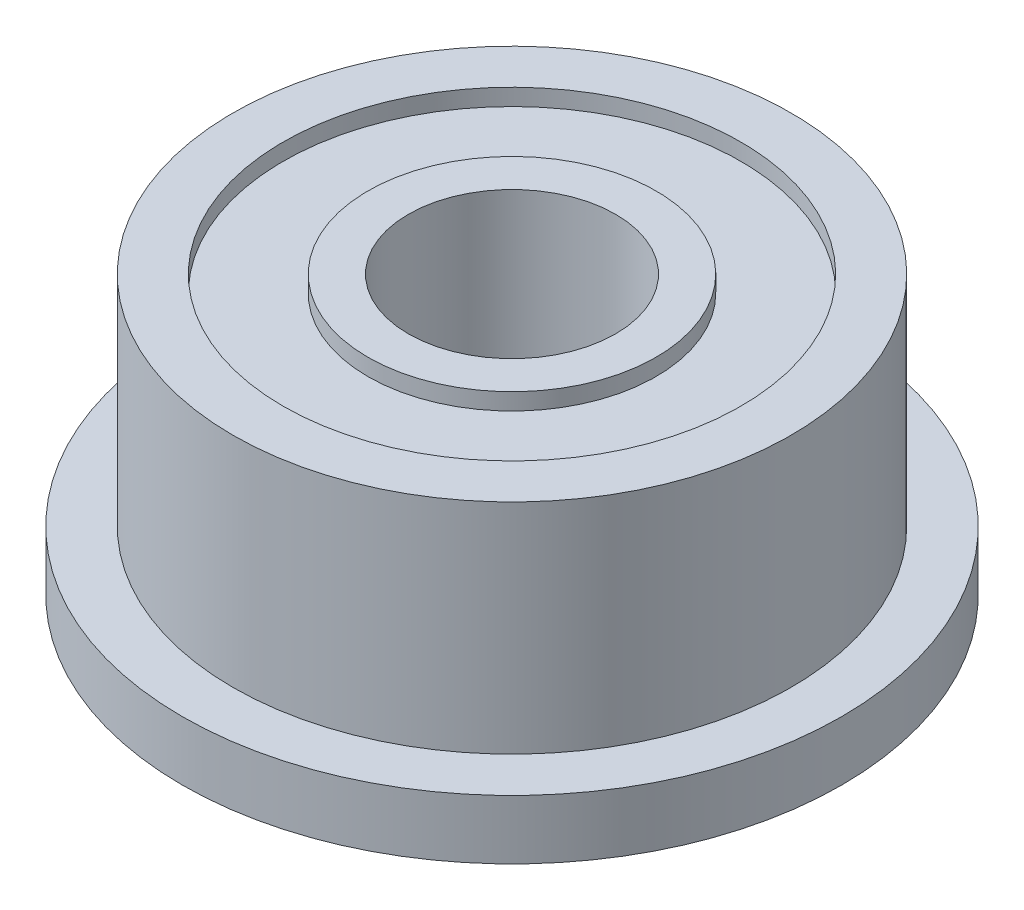
ISO-10303-21;
HEADER;
FILE_DESCRIPTION(('STEP AP214'),'2;1');
FILE_NAME('part.step','',(''),(''),'','','');
FILE_SCHEMA(('AUTOMOTIVE_DESIGN { 1 0 10303 214 1 1 1 1 }'));
ENDSEC;
DATA;
#1=APPLICATION_CONTEXT('core data for automotive mechanical design processes');
#2=APPLICATION_PROTOCOL_DEFINITION('international standard','automotive_design',2000,#1);
#3=PRODUCT_CONTEXT('',#1,'mechanical');
#4=PRODUCT('Part','Part','',(#3));
#5=PRODUCT_RELATED_PRODUCT_CATEGORY('part','',(#4));
#6=PRODUCT_DEFINITION_FORMATION('','',#4);
#7=PRODUCT_DEFINITION_CONTEXT('part definition',#1,'design');
#8=PRODUCT_DEFINITION('design','',#6,#7);
#9=PRODUCT_DEFINITION_SHAPE('','',#8);
#10=(LENGTH_UNIT() NAMED_UNIT(*) SI_UNIT(.MILLI.,.METRE.));
#11=(NAMED_UNIT(*) PLANE_ANGLE_UNIT() SI_UNIT($,.RADIAN.));
#12=(NAMED_UNIT(*) SI_UNIT($,.STERADIAN.) SOLID_ANGLE_UNIT());
#13=UNCERTAINTY_MEASURE_WITH_UNIT(LENGTH_MEASURE(1.E-05),#10,'distance_accuracy_value','');
#14=(GEOMETRIC_REPRESENTATION_CONTEXT(3) GLOBAL_UNCERTAINTY_ASSIGNED_CONTEXT((#13)) GLOBAL_UNIT_ASSIGNED_CONTEXT((#10,
#11,#12)) REPRESENTATION_CONTEXT('',''));
#15=CARTESIAN_POINT('',(0.,0.,0.));
#16=DIRECTION('',(0.,0.,1.));
#17=DIRECTION('',(1.,0.,0.));
#18=AXIS2_PLACEMENT_3D('',#15,#16,#17);
#19=CARTESIAN_POINT('',(3.28,0.24,0.));
#20=DIRECTION('',(0.,-1.,0.));
#21=DIRECTION('',(0.,0.,-1.));
#22=AXIS2_PLACEMENT_3D('',#19,#20,#21);
#23=PLANE('',#22);
#24=CARTESIAN_POINT('',(0.,0.24,0.));
#25=DIRECTION('',(0.,1.,0.));
#26=DIRECTION('',(0.,0.,1.));
#27=AXIS2_PLACEMENT_3D('',#24,#25,#26);
#28=CIRCLE('',#27,2.065);
#29=CARTESIAN_POINT('',(0.,0.24,2.065));
#30=VERTEX_POINT('',#29);
#31=EDGE_CURVE('E77',#30,#30,#28,.T.);
#32=ORIENTED_EDGE('',*,*,#31,.T.);
#33=EDGE_LOOP('',(#32));
#34=FACE_BOUND('',#33,.T.);
#35=CARTESIAN_POINT('',(0.,0.24,0.));
#36=DIRECTION('',(0.,1.,0.));
#37=DIRECTION('',(0.,0.,1.));
#38=AXIS2_PLACEMENT_3D('',#35,#36,#37);
#39=CIRCLE('',#38,3.28);
#40=CARTESIAN_POINT('',(0.,0.24,3.28));
#41=VERTEX_POINT('',#40);
#42=EDGE_CURVE('E10',#41,#41,#39,.T.);
#43=ORIENTED_EDGE('',*,*,#42,.F.);
#44=EDGE_LOOP('',(#43));
#45=FACE_BOUND('',#44,.T.);
#46=ADVANCED_FACE('F31',(#34,#45),#23,.T.);
#47=CARTESIAN_POINT('',(0.,0.,0.));
#48=DIRECTION('',(0.,1.,0.));
#49=DIRECTION('',(0.,0.,1.));
#50=AXIS2_PLACEMENT_3D('',#47,#48,#49);
#51=CYLINDRICAL_SURFACE('',#50,3.28);
#52=ORIENTED_EDGE('',*,*,#42,.T.);
#53=EDGE_LOOP('',(#52));
#54=FACE_BOUND('',#53,.T.);
#55=CARTESIAN_POINT('',(0.,0.,0.));
#56=DIRECTION('',(0.,1.,0.));
#57=DIRECTION('',(0.,0.,1.));
#58=AXIS2_PLACEMENT_3D('',#55,#56,#57);
#59=CIRCLE('',#58,3.28);
#60=CARTESIAN_POINT('',(0.,0.,3.28));
#61=VERTEX_POINT('',#60);
#62=EDGE_CURVE('E37',#61,#61,#59,.T.);
#63=ORIENTED_EDGE('',*,*,#62,.F.);
#64=EDGE_LOOP('',(#63));
#65=FACE_BOUND('',#64,.T.);
#66=ADVANCED_FACE('F95',(#54,#65),#51,.F.);
#67=CARTESIAN_POINT('',(4.725,0.,0.));
#68=DIRECTION('',(0.,-1.,0.));
#69=DIRECTION('',(0.,0.,-1.));
#70=AXIS2_PLACEMENT_3D('',#67,#68,#69);
#71=PLANE('',#70);
#72=ORIENTED_EDGE('',*,*,#62,.T.);
#73=EDGE_LOOP('',(#72));
#74=FACE_BOUND('',#73,.T.);
#75=CARTESIAN_POINT('',(0.,0.,0.));
#76=DIRECTION('',(0.,1.,0.));
#77=DIRECTION('',(0.,0.,1.));
#78=AXIS2_PLACEMENT_3D('',#75,#76,#77);
#79=CIRCLE('',#78,4.725);
#80=CARTESIAN_POINT('',(0.,0.,4.725));
#81=VERTEX_POINT('',#80);
#82=EDGE_CURVE('E41',#81,#81,#79,.T.);
#83=ORIENTED_EDGE('',*,*,#82,.F.);
#84=EDGE_LOOP('',(#83));
#85=FACE_BOUND('',#84,.T.);
#86=ADVANCED_FACE('F99',(#74,#85),#71,.T.);
#87=CARTESIAN_POINT('',(0.,0.,0.));
#88=DIRECTION('',(0.,1.,0.));
#89=DIRECTION('',(0.,0.,1.));
#90=AXIS2_PLACEMENT_3D('',#87,#88,#89);
#91=CYLINDRICAL_SURFACE('',#90,4.725);
#92=ORIENTED_EDGE('',*,*,#82,.T.);
#93=EDGE_LOOP('',(#92));
#94=FACE_BOUND('',#93,.T.);
#95=CARTESIAN_POINT('',(0.,0.85,0.));
#96=DIRECTION('',(0.,1.,0.));
#97=DIRECTION('',(0.,0.,1.));
#98=AXIS2_PLACEMENT_3D('',#95,#96,#97);
#99=CIRCLE('',#98,4.725);
#100=CARTESIAN_POINT('',(0.,0.85,4.725));
#101=VERTEX_POINT('',#100);
#102=EDGE_CURVE('E45',#101,#101,#99,.T.);
#103=ORIENTED_EDGE('',*,*,#102,.F.);
#104=EDGE_LOOP('',(#103));
#105=FACE_BOUND('',#104,.T.);
#106=ADVANCED_FACE('F103',(#94,#105),#91,.T.);
#107=CARTESIAN_POINT('',(4.,0.85,0.));
#108=DIRECTION('',(0.,1.,0.));
#109=DIRECTION('',(0.,0.,1.));
#110=AXIS2_PLACEMENT_3D('',#107,#108,#109);
#111=PLANE('',#110);
#112=ORIENTED_EDGE('',*,*,#102,.T.);
#113=EDGE_LOOP('',(#112));
#114=FACE_BOUND('',#113,.T.);
#115=CARTESIAN_POINT('',(0.,0.85,0.));
#116=DIRECTION('',(0.,1.,0.));
#117=DIRECTION('',(0.,0.,1.));
#118=AXIS2_PLACEMENT_3D('',#115,#116,#117);
#119=CIRCLE('',#118,4.);
#120=CARTESIAN_POINT('',(0.,0.85,4.));
#121=VERTEX_POINT('',#120);
#122=EDGE_CURVE('E50',#121,#121,#119,.T.);
#123=ORIENTED_EDGE('',*,*,#122,.F.);
#124=EDGE_LOOP('',(#123));
#125=FACE_BOUND('',#124,.T.);
#126=ADVANCED_FACE('F109',(#114,#125),#111,.T.);
#127=CARTESIAN_POINT('',(0.,0.,0.));
#128=DIRECTION('',(0.,1.,0.));
#129=DIRECTION('',(0.,0.,1.));
#130=AXIS2_PLACEMENT_3D('',#127,#128,#129);
#131=CYLINDRICAL_SURFACE('',#130,4.);
#132=ORIENTED_EDGE('',*,*,#122,.T.);
#133=EDGE_LOOP('',(#132));
#134=FACE_BOUND('',#133,.T.);
#135=CARTESIAN_POINT('',(0.,3.98,0.));
#136=DIRECTION('',(0.,1.,0.));
#137=DIRECTION('',(0.,0.,1.));
#138=AXIS2_PLACEMENT_3D('',#135,#136,#137);
#139=CIRCLE('',#138,4.);
#140=CARTESIAN_POINT('',(0.,3.98,4.));
#141=VERTEX_POINT('',#140);
#142=EDGE_CURVE('E53',#141,#141,#139,.T.);
#143=ORIENTED_EDGE('',*,*,#142,.F.);
#144=EDGE_LOOP('',(#143));
#145=FACE_BOUND('',#144,.T.);
#146=ADVANCED_FACE('F113',(#134,#145),#131,.T.);
#147=CARTESIAN_POINT('',(3.28,3.98,0.));
#148=DIRECTION('',(0.,1.,0.));
#149=DIRECTION('',(0.,0.,1.));
#150=AXIS2_PLACEMENT_3D('',#147,#148,#149);
#151=PLANE('',#150);
#152=ORIENTED_EDGE('',*,*,#142,.T.);
#153=EDGE_LOOP('',(#152));
#154=FACE_BOUND('',#153,.T.);
#155=CARTESIAN_POINT('',(0.,3.98,0.));
#156=DIRECTION('',(0.,1.,0.));
#157=DIRECTION('',(0.,0.,1.));
#158=AXIS2_PLACEMENT_3D('',#155,#156,#157);
#159=CIRCLE('',#158,3.28);
#160=CARTESIAN_POINT('',(0.,3.98,3.28));
#161=VERTEX_POINT('',#160);
#162=EDGE_CURVE('E56',#161,#161,#159,.T.);
#163=ORIENTED_EDGE('',*,*,#162,.F.);
#164=EDGE_LOOP('',(#163));
#165=FACE_BOUND('',#164,.T.);
#166=ADVANCED_FACE('F117',(#154,#165),#151,.T.);
#167=CARTESIAN_POINT('',(0.,0.,0.));
#168=DIRECTION('',(0.,1.,0.));
#169=DIRECTION('',(0.,0.,1.));
#170=AXIS2_PLACEMENT_3D('',#167,#168,#169);
#171=CYLINDRICAL_SURFACE('',#170,3.28);
#172=ORIENTED_EDGE('',*,*,#162,.T.);
#173=EDGE_LOOP('',(#172));
#174=FACE_BOUND('',#173,.T.);
#175=CARTESIAN_POINT('',(0.,3.74,0.));
#176=DIRECTION('',(0.,1.,0.));
#177=DIRECTION('',(0.,0.,1.));
#178=AXIS2_PLACEMENT_3D('',#175,#176,#177);
#179=CIRCLE('',#178,3.28);
#180=CARTESIAN_POINT('',(0.,3.74,3.28));
#181=VERTEX_POINT('',#180);
#182=EDGE_CURVE('E59',#181,#181,#179,.T.);
#183=ORIENTED_EDGE('',*,*,#182,.F.);
#184=EDGE_LOOP('',(#183));
#185=FACE_BOUND('',#184,.T.);
#186=ADVANCED_FACE('F121',(#174,#185),#171,.F.);
#187=CARTESIAN_POINT('',(2.065,3.74,0.));
#188=DIRECTION('',(0.,1.,0.));
#189=DIRECTION('',(0.,0.,1.));
#190=AXIS2_PLACEMENT_3D('',#187,#188,#189);
#191=PLANE('',#190);
#192=ORIENTED_EDGE('',*,*,#182,.T.);
#193=EDGE_LOOP('',(#192));
#194=FACE_BOUND('',#193,.T.);
#195=CARTESIAN_POINT('',(0.,3.74,0.));
#196=DIRECTION('',(0.,1.,0.));
#197=DIRECTION('',(0.,0.,1.));
#198=AXIS2_PLACEMENT_3D('',#195,#196,#197);
#199=CIRCLE('',#198,2.065);
#200=CARTESIAN_POINT('',(0.,3.74,2.065));
#201=VERTEX_POINT('',#200);
#202=EDGE_CURVE('E62',#201,#201,#199,.T.);
#203=ORIENTED_EDGE('',*,*,#202,.F.);
#204=EDGE_LOOP('',(#203));
#205=FACE_BOUND('',#204,.T.);
#206=ADVANCED_FACE('F125',(#194,#205),#191,.T.);
#207=CARTESIAN_POINT('',(0.,0.,0.));
#208=DIRECTION('',(0.,1.,0.));
#209=DIRECTION('',(0.,0.,1.));
#210=AXIS2_PLACEMENT_3D('',#207,#208,#209);
#211=CYLINDRICAL_SURFACE('',#210,2.065);
#212=ORIENTED_EDGE('',*,*,#202,.T.);
#213=EDGE_LOOP('',(#212));
#214=FACE_BOUND('',#213,.T.);
#215=CARTESIAN_POINT('',(0.,3.98,0.));
#216=DIRECTION('',(0.,1.,0.));
#217=DIRECTION('',(0.,0.,1.));
#218=AXIS2_PLACEMENT_3D('',#215,#216,#217);
#219=CIRCLE('',#218,2.065);
#220=CARTESIAN_POINT('',(0.,3.98,2.065));
#221=VERTEX_POINT('',#220);
#222=EDGE_CURVE('E65',#221,#221,#219,.T.);
#223=ORIENTED_EDGE('',*,*,#222,.F.);
#224=EDGE_LOOP('',(#223));
#225=FACE_BOUND('',#224,.T.);
#226=ADVANCED_FACE('F129',(#214,#225),#211,.T.);
#227=CARTESIAN_POINT('',(1.485,3.98,0.));
#228=DIRECTION('',(0.,1.,0.));
#229=DIRECTION('',(0.,0.,1.));
#230=AXIS2_PLACEMENT_3D('',#227,#228,#229);
#231=PLANE('',#230);
#232=ORIENTED_EDGE('',*,*,#222,.T.);
#233=EDGE_LOOP('',(#232));
#234=FACE_BOUND('',#233,.T.);
#235=CARTESIAN_POINT('',(0.,3.98,0.));
#236=DIRECTION('',(0.,1.,0.));
#237=DIRECTION('',(0.,0.,1.));
#238=AXIS2_PLACEMENT_3D('',#235,#236,#237);
#239=CIRCLE('',#238,1.485);
#240=CARTESIAN_POINT('',(0.,3.98,1.485));
#241=VERTEX_POINT('',#240);
#242=EDGE_CURVE('E68',#241,#241,#239,.T.);
#243=ORIENTED_EDGE('',*,*,#242,.F.);
#244=EDGE_LOOP('',(#243));
#245=FACE_BOUND('',#244,.T.);
#246=ADVANCED_FACE('F133',(#234,#245),#231,.T.);
#247=CARTESIAN_POINT('',(0.,0.,0.));
#248=DIRECTION('',(0.,1.,0.));
#249=DIRECTION('',(0.,0.,1.));
#250=AXIS2_PLACEMENT_3D('',#247,#248,#249);
#251=CYLINDRICAL_SURFACE('',#250,1.485);
#252=ORIENTED_EDGE('',*,*,#242,.T.);
#253=EDGE_LOOP('',(#252));
#254=FACE_BOUND('',#253,.T.);
#255=CARTESIAN_POINT('',(0.,0.,0.));
#256=DIRECTION('',(0.,1.,0.));
#257=DIRECTION('',(0.,0.,1.));
#258=AXIS2_PLACEMENT_3D('',#255,#256,#257);
#259=CIRCLE('',#258,1.485);
#260=CARTESIAN_POINT('',(0.,0.,1.485));
#261=VERTEX_POINT('',#260);
#262=EDGE_CURVE('E71',#261,#261,#259,.T.);
#263=ORIENTED_EDGE('',*,*,#262,.F.);
#264=EDGE_LOOP('',(#263));
#265=FACE_BOUND('',#264,.T.);
#266=ADVANCED_FACE('F91',(#254,#265),#251,.F.);
#267=CARTESIAN_POINT('',(2.065,0.,0.));
#268=DIRECTION('',(0.,-1.,0.));
#269=DIRECTION('',(0.,0.,-1.));
#270=AXIS2_PLACEMENT_3D('',#267,#268,#269);
#271=PLANE('',#270);
#272=ORIENTED_EDGE('',*,*,#262,.T.);
#273=EDGE_LOOP('',(#272));
#274=FACE_BOUND('',#273,.T.);
#275=CARTESIAN_POINT('',(0.,0.,0.));
#276=DIRECTION('',(0.,1.,0.));
#277=DIRECTION('',(0.,0.,1.));
#278=AXIS2_PLACEMENT_3D('',#275,#276,#277);
#279=CIRCLE('',#278,2.065);
#280=CARTESIAN_POINT('',(0.,0.,2.065));
#281=VERTEX_POINT('',#280);
#282=EDGE_CURVE('E74',#281,#281,#279,.T.);
#283=ORIENTED_EDGE('',*,*,#282,.F.);
#284=EDGE_LOOP('',(#283));
#285=FACE_BOUND('',#284,.T.);
#286=ADVANCED_FACE('F85',(#274,#285),#271,.T.);
#287=CARTESIAN_POINT('',(0.,0.,0.));
#288=DIRECTION('',(0.,1.,0.));
#289=DIRECTION('',(0.,0.,1.));
#290=AXIS2_PLACEMENT_3D('',#287,#288,#289);
#291=CYLINDRICAL_SURFACE('',#290,2.065);
#292=ORIENTED_EDGE('',*,*,#282,.T.);
#293=EDGE_LOOP('',(#292));
#294=FACE_BOUND('',#293,.T.);
#295=ORIENTED_EDGE('',*,*,#31,.F.);
#296=EDGE_LOOP('',(#295));
#297=FACE_BOUND('',#296,.T.);
#298=ADVANCED_FACE('F83',(#294,#297),#291,.T.);
#299=CLOSED_SHELL('',(#46,#66,#86,#106,#126,#146,#166,#186,#206,#226,#246,#266,#286,#298));
#300=MANIFOLD_SOLID_BREP('B2',#299);
#301=ADVANCED_BREP_SHAPE_REPRESENTATION('',(#18,#300),#14);
#302=SHAPE_DEFINITION_REPRESENTATION(#9,#301);
ENDSEC;
END-ISO-10303-21;
